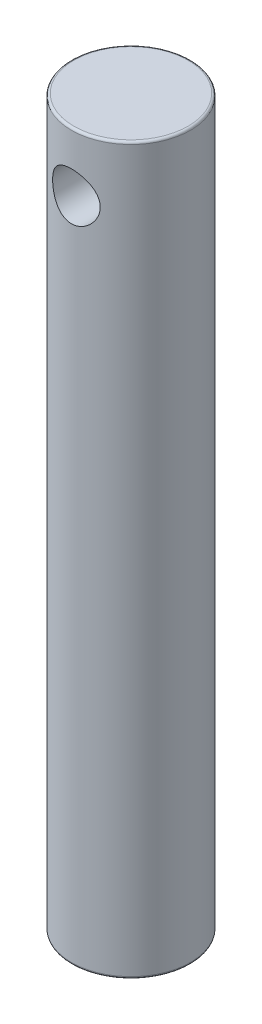
ISO-10303-21;
HEADER;
FILE_DESCRIPTION(('STEP AP214'),'2;1');
FILE_NAME('part.step','',(''),(''),'','','');
FILE_SCHEMA(('AUTOMOTIVE_DESIGN { 1 0 10303 214 1 1 1 1 }'));
ENDSEC;
DATA;
#1=APPLICATION_CONTEXT('core data for automotive mechanical design processes');
#2=APPLICATION_PROTOCOL_DEFINITION('international standard','automotive_design',2000,#1);
#3=PRODUCT_CONTEXT('',#1,'mechanical');
#4=PRODUCT('Part','Part','',(#3));
#5=PRODUCT_RELATED_PRODUCT_CATEGORY('part','',(#4));
#6=PRODUCT_DEFINITION_FORMATION('','',#4);
#7=PRODUCT_DEFINITION_CONTEXT('part definition',#1,'design');
#8=PRODUCT_DEFINITION('design','',#6,#7);
#9=PRODUCT_DEFINITION_SHAPE('','',#8);
#10=(LENGTH_UNIT() NAMED_UNIT(*) SI_UNIT(.MILLI.,.METRE.));
#11=(NAMED_UNIT(*) PLANE_ANGLE_UNIT() SI_UNIT($,.RADIAN.));
#12=(NAMED_UNIT(*) SI_UNIT($,.STERADIAN.) SOLID_ANGLE_UNIT());
#13=UNCERTAINTY_MEASURE_WITH_UNIT(LENGTH_MEASURE(1.E-05),#10,'distance_accuracy_value','');
#14=(GEOMETRIC_REPRESENTATION_CONTEXT(3) GLOBAL_UNCERTAINTY_ASSIGNED_CONTEXT((#13)) GLOBAL_UNIT_ASSIGNED_CONTEXT((#10,
#11,#12)) REPRESENTATION_CONTEXT('',''));
#15=CARTESIAN_POINT('',(0.,0.,0.));
#16=DIRECTION('',(0.,0.,1.));
#17=DIRECTION('',(1.,0.,0.));
#18=AXIS2_PLACEMENT_3D('',#15,#16,#17);
#19=CARTESIAN_POINT('',(0.,0.,0.));
#20=DIRECTION('',(0.,1.,0.));
#21=DIRECTION('',(0.,0.,1.));
#22=AXIS2_PLACEMENT_3D('',#19,#20,#21);
#23=PLANE('',#22);
#24=CARTESIAN_POINT('',(0.,0.,0.));
#25=DIRECTION('',(0.,1.,0.));
#26=DIRECTION('',(0.,0.,1.));
#27=AXIS2_PLACEMENT_3D('',#24,#25,#26);
#28=CIRCLE('',#27,12.);
#29=CARTESIAN_POINT('',(0.,0.,12.));
#30=VERTEX_POINT('',#29);
#31=EDGE_CURVE('E56',#30,#30,#28,.F.);
#32=ORIENTED_EDGE('',*,*,#31,.T.);
#33=EDGE_LOOP('',(#32));
#34=FACE_BOUND('',#33,.T.);
#35=ADVANCED_FACE('F49',(#34),#23,.F.);
#36=CARTESIAN_POINT('',(0.,152.4,0.));
#37=DIRECTION('',(0.,1.,0.));
#38=DIRECTION('',(0.,0.,1.));
#39=AXIS2_PLACEMENT_3D('',#36,#37,#38);
#40=PLANE('',#39);
#41=CARTESIAN_POINT('',(0.,152.4,0.));
#42=DIRECTION('',(0.,1.,0.));
#43=DIRECTION('',(0.,0.,1.));
#44=AXIS2_PLACEMENT_3D('',#41,#42,#43);
#45=CIRCLE('',#44,12.);
#46=CARTESIAN_POINT('',(0.,152.4,12.));
#47=VERTEX_POINT('',#46);
#48=EDGE_CURVE('E11',#47,#47,#45,.T.);
#49=ORIENTED_EDGE('',*,*,#48,.T.);
#50=EDGE_LOOP('',(#49));
#51=FACE_BOUND('',#50,.T.);
#52=ADVANCED_FACE('F96',(#51),#40,.T.);
#53=CARTESIAN_POINT('',(0.,0.,0.));
#54=DIRECTION('',(0.,1.,0.));
#55=DIRECTION('',(0.,0.,1.));
#56=AXIS2_PLACEMENT_3D('',#53,#54,#55);
#57=CYLINDRICAL_SURFACE('',#56,12.5);
#58=CARTESIAN_POINT('',(0.,0.5,0.));
#59=DIRECTION('',(0.,1.,0.));
#60=DIRECTION('',(0.,0.,1.));
#61=AXIS2_PLACEMENT_3D('',#58,#59,#60);
#62=CIRCLE('',#61,12.5);
#63=CARTESIAN_POINT('',(0.,0.5,12.5));
#64=VERTEX_POINT('',#63);
#65=EDGE_CURVE('E60',#64,#64,#62,.T.);
#66=ORIENTED_EDGE('',*,*,#65,.T.);
#67=EDGE_LOOP('',(#66));
#68=FACE_BOUND('',#67,.T.);
#69=CARTESIAN_POINT('',(0.,151.9,0.));
#70=DIRECTION('',(0.,1.,0.));
#71=DIRECTION('',(0.,0.,1.));
#72=AXIS2_PLACEMENT_3D('',#69,#70,#71);
#73=CIRCLE('',#72,12.5);
#74=CARTESIAN_POINT('',(0.,151.9,12.5));
#75=VERTEX_POINT('',#74);
#76=EDGE_CURVE('E64',#75,#75,#73,.F.);
#77=ORIENTED_EDGE('',*,*,#76,.T.);
#78=EDGE_LOOP('',(#77));
#79=FACE_BOUND('',#78,.T.);
#80=CARTESIAN_POINT('',(0.,144.9,-12.5));
#81=CARTESIAN_POINT('',(0.134428040880245,144.899999227433,-12.4999993987147));
#82=CARTESIAN_POINT('',(0.268907963042153,144.894571226906,-12.4978254430454));
#83=CARTESIAN_POINT('',(0.536916320402138,144.872908256117,-12.4891841268811));
#84=CARTESIAN_POINT('',(0.670444059868572,144.856666067978,-12.482713898868));
#85=CARTESIAN_POINT('',(0.935792063184506,144.813491255257,-12.4656328522576));
#86=CARTESIAN_POINT('',(1.06760803727625,144.78653571455,-12.45501315868));
#87=CARTESIAN_POINT('',(1.32834211367394,144.722193495869,-12.4299104474403));
#88=CARTESIAN_POINT('',(1.45725900847256,144.68480255528,-12.4154258511634));
#89=CARTESIAN_POINT('',(1.71081101883519,144.600097686712,-12.3830283866279));
#90=CARTESIAN_POINT('',(1.83546024588383,144.552821089229,-12.3651284371665));
#91=CARTESIAN_POINT('',(2.08021423561347,144.448672994588,-12.3263173159861));
#92=CARTESIAN_POINT('',(2.20031728026545,144.391797913562,-12.3054050199506));
#93=CARTESIAN_POINT('',(2.5525365078776,144.207506936614,-12.2389309759606));
#94=CARTESIAN_POINT('',(2.77691477785267,144.066306786435,-12.1895849490044));
#95=CARTESIAN_POINT('',(3.20878788906516,143.744405075527,-12.0832695338299));
#96=CARTESIAN_POINT('',(3.41514420143945,143.562267799413,-12.0260638001945));
#97=CARTESIAN_POINT('',(3.79544899749701,143.166465534496,-11.9115080425799));
#98=CARTESIAN_POINT('',(3.96938162582803,142.952785212015,-11.8541579618342));
#99=CARTESIAN_POINT('',(4.20603567526882,142.607393942085,-11.7714356850167));
#100=CARTESIAN_POINT('',(4.28222203675303,142.485220084906,-11.7438622045772));
#101=CARTESIAN_POINT('',(4.42396507270082,142.234363844583,-11.6912035308498));
#102=CARTESIAN_POINT('',(4.4895261186149,142.105684166787,-11.6661173159128));
#103=CARTESIAN_POINT('',(4.60945924526238,141.842624566928,-11.6192528850806));
#104=CARTESIAN_POINT('',(4.66383056922586,141.708244260069,-11.5974748929493));
#105=CARTESIAN_POINT('',(4.76082403397005,141.434791130423,-11.5579971517723));
#106=CARTESIAN_POINT('',(4.80345206019441,141.29572069758,-11.5402953605706));
#107=CARTESIAN_POINT('',(4.87487504470654,141.020233803028,-11.5103008899763));
#108=CARTESIAN_POINT('',(4.90420529162586,140.883978665748,-11.4978009817217));
#109=CARTESIAN_POINT('',(4.95140857029289,140.609206324517,-11.4775526697411));
#110=CARTESIAN_POINT('',(4.96928677630621,140.470690171191,-11.4698021202267));
#111=CARTESIAN_POINT('',(4.99338985465939,140.192486721196,-11.4593294452386));
#112=CARTESIAN_POINT('',(4.99961718879243,140.052799678199,-11.4566062575003));
#113=CARTESIAN_POINT('',(5.0003485097598,139.773392457526,-11.4562871877305));
#114=CARTESIAN_POINT('',(4.99485304337849,139.6336722817,-11.4586910665582));
#115=CARTESIAN_POINT('',(4.97300139062979,139.365095752802,-11.4681900884033));
#116=CARTESIAN_POINT('',(4.95743098313014,139.23616251655,-11.4749456688599));
#117=CARTESIAN_POINT('',(4.91636669802671,138.980133169352,-11.4925992446822));
#118=CARTESIAN_POINT('',(4.89086955440044,138.853037677336,-11.5034986033759));
#119=CARTESIAN_POINT('',(4.83020381694143,138.601598275734,-11.5291029107708));
#120=CARTESIAN_POINT('',(4.79503755159834,138.477253711458,-11.5438069431915));
#121=CARTESIAN_POINT('',(4.71535272789896,138.232038157591,-11.5765839862007));
#122=CARTESIAN_POINT('',(4.67083057532248,138.111168523299,-11.5946582912342));
#123=CARTESIAN_POINT('',(4.52178156820716,137.750100229774,-11.6539749295159));
#124=CARTESIAN_POINT('',(4.40296429143379,137.516367028503,-11.6997808532441));
#125=CARTESIAN_POINT('',(4.13125151068097,137.071420317866,-11.7984565398875));
#126=CARTESIAN_POINT('',(3.97834320762598,136.860215310592,-11.851328952839));
#127=CARTESIAN_POINT('',(3.62889137093418,136.448992554911,-11.9631659230739));
#128=CARTESIAN_POINT('',(3.42988845371519,136.251101706164,-12.0222854697289));
#129=CARTESIAN_POINT('',(3.00074126337521,135.890765270535,-12.1365017798563));
#130=CARTESIAN_POINT('',(2.77059080292405,135.728326742903,-12.1915977407036));
#131=CARTESIAN_POINT('',(2.40397180160013,135.513475040348,-12.2673153503505));
#132=CARTESIAN_POINT('',(2.2767950068552,135.446127372932,-12.2916102280984));
#133=CARTESIAN_POINT('',(2.01664956005586,135.322464443625,-12.3369572045585));
#134=CARTESIAN_POINT('',(1.88368330291786,135.266144671861,-12.3580106281118));
#135=CARTESIAN_POINT('',(1.61291597890483,135.165088415445,-12.3962575592558));
#136=CARTESIAN_POINT('',(1.47511586065892,135.120349672337,-12.4134518193484));
#137=CARTESIAN_POINT('',(1.19570710246717,135.042913084145,-12.4434728637469));
#138=CARTESIAN_POINT('',(1.05409872694102,135.010214405384,-12.4562999504395));
#139=CARTESIAN_POINT('',(0.776729176174356,134.958806836453,-12.4765727481541));
#140=CARTESIAN_POINT('',(0.641120300634826,134.939382345743,-12.4842928466038));
#141=CARTESIAN_POINT('',(0.368536353136397,134.911718547215,-12.4953107019161));
#142=CARTESIAN_POINT('',(0.231560830747312,134.903483058669,-12.4986069487295));
#143=CARTESIAN_POINT('',(-0.0425534985314554,134.898303289166,-12.5006785657441));
#144=CARTESIAN_POINT('',(-0.179692155300511,134.901352139062,-12.4994566862774));
#145=CARTESIAN_POINT('',(-0.45319364607851,134.918695177459,-12.4925311411113));
#146=CARTESIAN_POINT('',(-0.5895561770989,134.932993489901,-12.4868258318318));
#147=CARTESIAN_POINT('',(-0.854248709448701,134.971782113967,-12.4714486467531));
#148=CARTESIAN_POINT('',(-0.982662386499644,134.995780406528,-12.4619685467435));
#149=CARTESIAN_POINT('',(-1.236951486414,135.053665031866,-12.4393027914718));
#150=CARTESIAN_POINT('',(-1.36282600376894,135.087554827734,-12.4261158384722));
#151=CARTESIAN_POINT('',(-1.61115102742898,135.16490828446,-12.396363099589));
#152=CARTESIAN_POINT('',(-1.73360251217364,135.208369177319,-12.3797982906969));
#153=CARTESIAN_POINT('',(-1.97439656120157,135.304503016352,-12.3436873636138));
#154=CARTESIAN_POINT('',(-2.0927375418746,135.357179466743,-12.324140111711));
#155=CARTESIAN_POINT('',(-2.44755555665469,135.531907255414,-12.2604306254888));
#156=CARTESIAN_POINT('',(-2.67640599367797,135.668346020799,-12.2121249620384));
#157=CARTESIAN_POINT('',(-3.10864805700673,135.974868476162,-12.1093295542635));
#158=CARTESIAN_POINT('',(-3.31202942740563,136.144965649056,-12.0548373354639));
#159=CARTESIAN_POINT('',(-3.7017918032765,136.527158464545,-11.941130597789));
#160=CARTESIAN_POINT('',(-3.88616393977714,136.741285470906,-11.8818418268267));
#161=CARTESIAN_POINT('',(-4.21689889171291,137.19864859835,-11.7685360307743));
#162=CARTESIAN_POINT('',(-4.36325544343982,137.441889506805,-11.7145198753505));
#163=CARTESIAN_POINT('',(-4.55142555782972,137.825118670316,-11.6421255873514));
#164=CARTESIAN_POINT('',(-4.60914530472445,137.95667972936,-11.6193337971416));
#165=CARTESIAN_POINT('',(-4.7132051604585,138.224787165596,-11.5775147345674));
#166=CARTESIAN_POINT('',(-4.7595502120223,138.361331347702,-11.5584858277923));
#167=CARTESIAN_POINT('',(-4.84036067147022,138.63836312862,-11.5248785506309));
#168=CARTESIAN_POINT('',(-4.87483074938324,138.778849153677,-11.5102984309441));
#169=CARTESIAN_POINT('',(-4.93151664575949,139.062694625953,-11.4861263078956));
#170=CARTESIAN_POINT('',(-4.95373349010208,139.206053831579,-11.4765338869518));
#171=CARTESIAN_POINT('',(-4.9844819536379,139.483998964573,-11.463210572331));
#172=CARTESIAN_POINT('',(-4.99388565688381,139.618471214748,-11.4591065554863));
#173=CARTESIAN_POINT('',(-5.0018009363611,139.887846081921,-11.4556539611994));
#174=CARTESIAN_POINT('',(-5.00030885599691,140.022748828209,-11.4563069802054));
#175=CARTESIAN_POINT('',(-4.98644346125971,140.291817161394,-11.4623486992809));
#176=CARTESIAN_POINT('',(-4.97407559907525,140.425983083765,-11.4677350264728));
#177=CARTESIAN_POINT('',(-4.93860056102212,140.692672045274,-11.4830569283056));
#178=CARTESIAN_POINT('',(-4.91548933784265,140.82519444592,-11.4929942173944));
#179=CARTESIAN_POINT('',(-4.85990688487219,141.082329669663,-11.5166044402177));
#180=CARTESIAN_POINT('',(-4.82784722608916,141.207046793678,-11.5301119705796));
#181=CARTESIAN_POINT('',(-4.75435551317662,141.453266245097,-11.5606089073159));
#182=CARTESIAN_POINT('',(-4.71292020385953,141.574767439538,-11.5775995228101));
#183=CARTESIAN_POINT('',(-4.57505004689657,141.933314434634,-11.6330901679007));
#184=CARTESIAN_POINT('',(-4.46501084942241,142.164587265842,-11.6761269526907));
#185=CARTESIAN_POINT('',(-4.20467910946436,142.619056401713,-11.7724663792633));
#186=CARTESIAN_POINT('',(-4.052442544111,142.841032090103,-11.8262157202004));
#187=CARTESIAN_POINT('',(-3.71470108315129,143.257497882634,-11.9366014488494));
#188=CARTESIAN_POINT('',(-3.52918616017588,143.451979670697,-11.9932387030498));
#189=CARTESIAN_POINT('',(-3.22271513320783,143.725513480365,-12.0779292743326));
#190=CARTESIAN_POINT('',(-3.11206947531874,143.816056467989,-12.1069791824151));
#191=CARTESIAN_POINT('',(-2.88318647887271,143.98749937067,-12.1635153749863));
#192=CARTESIAN_POINT('',(-2.76495189987678,144.06840276075,-12.1910022210713));
#193=CARTESIAN_POINT('',(-2.52148785822199,144.22003376873,-12.2436771245731));
#194=CARTESIAN_POINT('',(-2.39625194428021,144.290751779554,-12.268863003586));
#195=CARTESIAN_POINT('',(-2.13974317443308,144.42130456519,-12.3161883140849));
#196=CARTESIAN_POINT('',(-2.00847311867465,144.481144325443,-12.338329139963));
#197=CARTESIAN_POINT('',(-1.7431850308944,144.588433224325,-12.378569273056));
#198=CARTESIAN_POINT('',(-1.60925996819087,144.636087336391,-12.3967345755768));
#199=CARTESIAN_POINT('',(-1.33744351766941,144.719902333695,-12.4289968049149));
#200=CARTESIAN_POINT('',(-1.19955402639713,144.756068618024,-12.4430956426169));
#201=CARTESIAN_POINT('',(-0.921178994399029,144.816469003764,-12.4667917847092));
#202=CARTESIAN_POINT('',(-0.780700905910178,144.84073306786,-12.4764003899058));
#203=CARTESIAN_POINT('',(-0.498015171774933,144.877174232699,-12.4908758978143));
#204=CARTESIAN_POINT('',(-0.355808918388266,144.889360484779,-12.4957463905343));
#205=CARTESIAN_POINT('',(-0.177825352118351,144.896963660736,-12.4987857872515));
#206=CARTESIAN_POINT('',(-0.142272352477998,144.898102034201,-12.4992409186622));
#207=CARTESIAN_POINT('',(-0.0711474464104167,144.899620305884,-12.4998481045291));
#208=CARTESIAN_POINT('',(-0.0355755399919987,144.900000204455,-12.5000001591264));
#209=CARTESIAN_POINT('',(0.,144.9,-12.5));
#210=B_SPLINE_CURVE_WITH_KNOTS('',3,(#80,#81,#82,#83,#84,#85,#86,#87,#88,#89,#90,#91,#92,#93,
#94,#95,#96,#97,#98,#99,#100,#101,#102,#103,#104,#105,#106,#107,#108,#109,#110,#111,#112,#113,
#114,#115,#116,#117,#118,#119,#120,#121,#122,#123,#124,#125,#126,#127,#128,#129,#130,#131,#132,
#133,#134,#135,#136,#137,#138,#139,#140,#141,#142,#143,#144,#145,#146,#147,#148,#149,#150,#151,
#152,#153,#154,#155,#156,#157,#158,#159,#160,#161,#162,#163,#164,#165,#166,#167,#168,#169,#170,
#171,#172,#173,#174,#175,#176,#177,#178,#179,#180,#181,#182,#183,#184,#185,#186,#187,#188,#189,
#190,#191,#192,#193,#194,#195,#196,#197,#198,#199,#200,#201,#202,#203,#204,#205,#206,#207,#208,
#209),.UNSPECIFIED.,.T.,.F.,(4,2,2,2,2,2,2,2,2,2,2,2,2,2,2,2,2,2,2,2,2,2,2,2,2,2,2,2,2,2,2,2,2,
2,2,2,2,2,2,2,2,2,2,2,2,2,2,2,2,2,2,2,2,2,2,2,2,2,2,2,2,2,2,2,4),(0.,0.403247545127348,
0.806764506023342,1.21114928538012,1.61569948871384,2.01874874890204,2.42194883328357,
3.22723902880424,4.06710473211457,4.90738006296491,5.3467199145422,5.78587855222681,
6.22506688081048,6.66403469721492,7.08328748777368,7.50235071750987,7.92132539047821,
8.34028052171747,8.72995920476623,9.119766205555,9.50947941625399,9.89934261638532,
10.6941760924545,11.4893084834387,12.345906664648,13.2026752559774,13.6400384630794,
14.0772224346054,14.5143210850114,14.9513894641978,15.3624968549506,15.7737445385294,
16.1847419233425,16.5958900459694,16.9883780843378,17.3810037009245,17.7735159174187,
18.1661777124847,18.9747143225964,19.783575475114,20.6458383532501,21.5082432137335,
21.9441519877961,22.379871006724,22.815418475839,23.2509294740085,23.655003908265,
24.0592139550412,24.4632214808538,24.8673813305822,25.2553678352619,25.6434892545336,
26.4191721859434,27.2392679922317,28.0596113245242,28.4968494117638,28.9339293970248,
29.3714189832268,29.8087075621829,30.2380680730948,30.667226491969,31.0952989296225,
31.5230467689858,31.6297637586308,31.7364806985967),.UNSPECIFIED.);
#211=CARTESIAN_POINT('',(0.,144.9,-12.5));
#212=VERTEX_POINT('',#211);
#213=EDGE_CURVE('E69',#212,#212,#210,.T.);
#214=ORIENTED_EDGE('',*,*,#213,.F.);
#215=EDGE_LOOP('',(#214));
#216=FACE_BOUND('',#215,.T.);
#217=CARTESIAN_POINT('',(0.,134.9,12.5));
#218=CARTESIAN_POINT('',(0.134428040880244,134.900000772567,12.4999993987147));
#219=CARTESIAN_POINT('',(0.268907963042151,134.905428773094,12.4978254430454));
#220=CARTESIAN_POINT('',(0.536916320402137,134.927091743883,12.4891841268811));
#221=CARTESIAN_POINT('',(0.670444059868572,134.943333932021,12.482713898868));
#222=CARTESIAN_POINT('',(0.935792063184506,134.986508744743,12.4656328522576));
#223=CARTESIAN_POINT('',(1.06760803727625,135.013464285449,12.45501315868));
#224=CARTESIAN_POINT('',(1.32834211367394,135.077806504131,12.4299104474403));
#225=CARTESIAN_POINT('',(1.45725900847257,135.11519744472,12.4154258511634));
#226=CARTESIAN_POINT('',(1.71081101883518,135.199902313288,12.3830283866279));
#227=CARTESIAN_POINT('',(1.83546024588382,135.247178910771,12.3651284371665));
#228=CARTESIAN_POINT('',(2.08021423561346,135.351327005412,12.3263173159861));
#229=CARTESIAN_POINT('',(2.20031728026544,135.408202086437,12.3054050199506));
#230=CARTESIAN_POINT('',(2.5525365078776,135.592493063386,12.2389309759606));
#231=CARTESIAN_POINT('',(2.77691477785267,135.733693213565,12.1895849490044));
#232=CARTESIAN_POINT('',(3.20878788906516,136.055594924473,12.0832695338299));
#233=CARTESIAN_POINT('',(3.41514420143945,136.237732200587,12.0260638001945));
#234=CARTESIAN_POINT('',(3.79544899749701,136.633534465503,11.9115080425799));
#235=CARTESIAN_POINT('',(3.96938162582803,136.847214787985,11.8541579618342));
#236=CARTESIAN_POINT('',(4.20603567526881,137.192606057915,11.7714356850167));
#237=CARTESIAN_POINT('',(4.28222203675301,137.314779915094,11.7438622045772));
#238=CARTESIAN_POINT('',(4.42396507270081,137.565636155417,11.6912035308498));
#239=CARTESIAN_POINT('',(4.4895261186149,137.694315833213,11.6661173159128));
#240=CARTESIAN_POINT('',(4.60945924526237,137.957375433072,11.6192528850806));
#241=CARTESIAN_POINT('',(4.66383056922586,138.091755739931,11.5974748929493));
#242=CARTESIAN_POINT('',(4.76082403397005,138.365208869577,11.5579971517723));
#243=CARTESIAN_POINT('',(4.80345206019441,138.50427930242,11.5402953605706));
#244=CARTESIAN_POINT('',(4.87487504470654,138.779766196972,11.5103008899763));
#245=CARTESIAN_POINT('',(4.90420529162586,138.916021334252,11.4978009817217));
#246=CARTESIAN_POINT('',(4.95140857029289,139.190793675483,11.4775526697411));
#247=CARTESIAN_POINT('',(4.9692867763062,139.329309828809,11.4698021202267));
#248=CARTESIAN_POINT('',(4.99338985465939,139.607513278804,11.4593294452386));
#249=CARTESIAN_POINT('',(4.99961718879243,139.747200321801,11.4566062575003));
#250=CARTESIAN_POINT('',(5.0003485097598,140.026607542473,11.4562871877305));
#251=CARTESIAN_POINT('',(4.99485304337849,140.1663277183,11.4586910665582));
#252=CARTESIAN_POINT('',(4.97300139062979,140.434904247198,11.4681900884033));
#253=CARTESIAN_POINT('',(4.95743098313014,140.56383748345,11.4749456688599));
#254=CARTESIAN_POINT('',(4.91636669802671,140.819866830648,11.4925992446822));
#255=CARTESIAN_POINT('',(4.89086955440044,140.946962322664,11.5034986033759));
#256=CARTESIAN_POINT('',(4.83020381694143,141.198401724266,11.5291029107708));
#257=CARTESIAN_POINT('',(4.79503755159834,141.322746288542,11.5438069431915));
#258=CARTESIAN_POINT('',(4.71535272789897,141.567961842409,11.5765839862007));
#259=CARTESIAN_POINT('',(4.67083057532248,141.688831476701,11.5946582912342));
#260=CARTESIAN_POINT('',(4.52178156820716,142.049899770226,11.6539749295159));
#261=CARTESIAN_POINT('',(4.40296429143379,142.283632971497,11.6997808532441));
#262=CARTESIAN_POINT('',(4.13125151068097,142.728579682134,11.7984565398875));
#263=CARTESIAN_POINT('',(3.97834320762598,142.939784689408,11.851328952839));
#264=CARTESIAN_POINT('',(3.62889137093418,143.351007445089,11.9631659230739));
#265=CARTESIAN_POINT('',(3.42988845371518,143.548898293836,12.0222854697289));
#266=CARTESIAN_POINT('',(3.00074126337521,143.909234729465,12.1365017798563));
#267=CARTESIAN_POINT('',(2.77059080292404,144.071673257097,12.1915977407036));
#268=CARTESIAN_POINT('',(2.40397180160013,144.286524959652,12.2673153503505));
#269=CARTESIAN_POINT('',(2.2767950068552,144.353872627068,12.2916102280984));
#270=CARTESIAN_POINT('',(2.01664956005586,144.477535556375,12.3369572045585));
#271=CARTESIAN_POINT('',(1.88368330291787,144.533855328139,12.3580106281118));
#272=CARTESIAN_POINT('',(1.61291597890484,144.634911584554,12.3962575592558));
#273=CARTESIAN_POINT('',(1.47511586065892,144.679650327663,12.4134518193484));
#274=CARTESIAN_POINT('',(1.19570710246718,144.757086915855,12.4434728637469));
#275=CARTESIAN_POINT('',(1.05409872694102,144.789785594616,12.4562999504395));
#276=CARTESIAN_POINT('',(0.776729176174355,144.841193163546,12.4765727481541));
#277=CARTESIAN_POINT('',(0.641120300634824,144.860617654257,12.4842928466038));
#278=CARTESIAN_POINT('',(0.368536353136395,144.888281452785,12.4953107019161));
#279=CARTESIAN_POINT('',(0.23156083074731,144.89651694133,12.4986069487295));
#280=CARTESIAN_POINT('',(-0.0425534985314563,144.901696710834,12.5006785657441));
#281=CARTESIAN_POINT('',(-0.179692155300512,144.898647860938,12.4994566862774));
#282=CARTESIAN_POINT('',(-0.453193646078511,144.881304822541,12.4925311411113));
#283=CARTESIAN_POINT('',(-0.5895561770989,144.867006510099,12.4868258318318));
#284=CARTESIAN_POINT('',(-0.854248709448701,144.828217886033,12.4714486467531));
#285=CARTESIAN_POINT('',(-0.982662386499644,144.804219593472,12.4619685467435));
#286=CARTESIAN_POINT('',(-1.236951486414,144.746334968134,12.4393027914718));
#287=CARTESIAN_POINT('',(-1.36282600376894,144.712445172266,12.4261158384722));
#288=CARTESIAN_POINT('',(-1.61115102742898,144.63509171554,12.396363099589));
#289=CARTESIAN_POINT('',(-1.73360251217364,144.591630822681,12.3797982906969));
#290=CARTESIAN_POINT('',(-1.97439656120157,144.495496983648,12.3436873636138));
#291=CARTESIAN_POINT('',(-2.0927375418746,144.442820533257,12.324140111711));
#292=CARTESIAN_POINT('',(-2.44755555665469,144.268092744586,12.2604306254888));
#293=CARTESIAN_POINT('',(-2.67640599367797,144.131653979201,12.2121249620384));
#294=CARTESIAN_POINT('',(-3.10864805700673,143.825131523838,12.1093295542635));
#295=CARTESIAN_POINT('',(-3.31202942740563,143.655034350944,12.0548373354639));
#296=CARTESIAN_POINT('',(-3.7017918032765,143.272841535455,11.941130597789));
#297=CARTESIAN_POINT('',(-3.88616393977714,143.058714529094,11.8818418268267));
#298=CARTESIAN_POINT('',(-4.21689889171291,142.60135140165,11.7685360307743));
#299=CARTESIAN_POINT('',(-4.36325544343982,142.358110493195,11.7145198753505));
#300=CARTESIAN_POINT('',(-4.55142555782972,141.974881329683,11.6421255873514));
#301=CARTESIAN_POINT('',(-4.60914530472445,141.84332027064,11.6193337971416));
#302=CARTESIAN_POINT('',(-4.7132051604585,141.575212834404,11.5775147345674));
#303=CARTESIAN_POINT('',(-4.7595502120223,141.438668652298,11.5584858277923));
#304=CARTESIAN_POINT('',(-4.84036067147022,141.16163687138,11.5248785506309));
#305=CARTESIAN_POINT('',(-4.87483074938324,141.021150846323,11.5102984309441));
#306=CARTESIAN_POINT('',(-4.93151664575949,140.737305374047,11.4861263078956));
#307=CARTESIAN_POINT('',(-4.95373349010208,140.593946168421,11.4765338869518));
#308=CARTESIAN_POINT('',(-4.9844819536379,140.316001035427,11.463210572331));
#309=CARTESIAN_POINT('',(-4.99388565688381,140.181528785252,11.4591065554863));
#310=CARTESIAN_POINT('',(-5.00180093636109,139.912153918079,11.4556539611994));
#311=CARTESIAN_POINT('',(-5.00030885599691,139.777251171791,11.4563069802054));
#312=CARTESIAN_POINT('',(-4.98644346125971,139.508182838606,11.4623486992809));
#313=CARTESIAN_POINT('',(-4.97407559907526,139.374016916235,11.4677350264728));
#314=CARTESIAN_POINT('',(-4.93860056102212,139.107327954726,11.4830569283056));
#315=CARTESIAN_POINT('',(-4.91548933784266,138.97480555408,11.4929942173944));
#316=CARTESIAN_POINT('',(-4.85990688487219,138.717670330337,11.5166044402177));
#317=CARTESIAN_POINT('',(-4.82784722608916,138.592953206322,11.5301119705796));
#318=CARTESIAN_POINT('',(-4.75435551317662,138.346733754903,11.5606089073159));
#319=CARTESIAN_POINT('',(-4.71292020385953,138.225232560462,11.5775995228101));
#320=CARTESIAN_POINT('',(-4.57505004689657,137.866685565366,11.6330901679007));
#321=CARTESIAN_POINT('',(-4.46501084942241,137.635412734158,11.6761269526907));
#322=CARTESIAN_POINT('',(-4.20467910946436,137.180943598287,11.7724663792633));
#323=CARTESIAN_POINT('',(-4.052442544111,136.958967909897,11.8262157202004));
#324=CARTESIAN_POINT('',(-3.71470108315128,136.542502117366,11.9366014488494));
#325=CARTESIAN_POINT('',(-3.52918616017588,136.348020329303,11.9932387030498));
#326=CARTESIAN_POINT('',(-3.22271513320783,136.074486519635,12.0779292743326));
#327=CARTESIAN_POINT('',(-3.11206947531874,135.983943532011,12.1069791824151));
#328=CARTESIAN_POINT('',(-2.88318647887271,135.81250062933,12.1635153749863));
#329=CARTESIAN_POINT('',(-2.76495189987678,135.73159723925,12.1910022210713));
#330=CARTESIAN_POINT('',(-2.52148785822199,135.57996623127,12.2436771245731));
#331=CARTESIAN_POINT('',(-2.3962519442802,135.509248220446,12.268863003586));
#332=CARTESIAN_POINT('',(-2.13974317443307,135.37869543481,12.3161883140849));
#333=CARTESIAN_POINT('',(-2.00847311867465,135.318855674557,12.338329139963));
#334=CARTESIAN_POINT('',(-1.7431850308944,135.211566775675,12.378569273056));
#335=CARTESIAN_POINT('',(-1.60925996819087,135.163912663609,12.3967345755768));
#336=CARTESIAN_POINT('',(-1.33744351766941,135.080097666305,12.4289968049149));
#337=CARTESIAN_POINT('',(-1.19955402639713,135.043931381976,12.4430956426169));
#338=CARTESIAN_POINT('',(-0.921178994399028,134.983530996236,12.4667917847092));
#339=CARTESIAN_POINT('',(-0.780700905910176,134.95926693214,12.4764003899058));
#340=CARTESIAN_POINT('',(-0.498015171774931,134.922825767301,12.4908758978143));
#341=CARTESIAN_POINT('',(-0.355808918388265,134.910639515221,12.4957463905343));
#342=CARTESIAN_POINT('',(-0.177825352118351,134.903036339264,12.4987857872515));
#343=CARTESIAN_POINT('',(-0.142272352477998,134.901897965799,12.4992409186622));
#344=CARTESIAN_POINT('',(-0.0711474464104167,134.900379694116,12.4998481045291));
#345=CARTESIAN_POINT('',(-0.0355755399919987,134.899999795545,12.5000001591264));
#346=CARTESIAN_POINT('',(0.,134.9,12.5));
#347=B_SPLINE_CURVE_WITH_KNOTS('',3,(#217,#218,#219,#220,#221,#222,#223,#224,#225,#226,#227,
#228,#229,#230,#231,#232,#233,#234,#235,#236,#237,#238,#239,#240,#241,#242,#243,#244,#245,#246,
#247,#248,#249,#250,#251,#252,#253,#254,#255,#256,#257,#258,#259,#260,#261,#262,#263,#264,#265,
#266,#267,#268,#269,#270,#271,#272,#273,#274,#275,#276,#277,#278,#279,#280,#281,#282,#283,#284,
#285,#286,#287,#288,#289,#290,#291,#292,#293,#294,#295,#296,#297,#298,#299,#300,#301,#302,#303,
#304,#305,#306,#307,#308,#309,#310,#311,#312,#313,#314,#315,#316,#317,#318,#319,#320,#321,#322,
#323,#324,#325,#326,#327,#328,#329,#330,#331,#332,#333,#334,#335,#336,#337,#338,#339,#340,#341,
#342,#343,#344,#345,#346),.UNSPECIFIED.,.T.,.F.,(4,2,2,2,2,2,2,2,2,2,2,2,2,2,2,2,2,2,2,2,2,2,2,
2,2,2,2,2,2,2,2,2,2,2,2,2,2,2,2,2,2,2,2,2,2,2,2,2,2,2,2,2,2,2,2,2,2,2,2,2,2,2,2,2,4),(0.,
0.403247545127346,0.806764506023342,1.21114928538012,1.61569948871384,2.01874874890202,
2.42194883328357,3.22723902880424,4.06710473211456,4.90738006296491,5.34671991454214,
5.78587855222681,6.22506688081048,6.66403469721492,7.08328748777368,7.50235071750981,
7.9213253904781,8.34028052171747,8.72995920476626,9.119766205555,9.50947941625396,
9.89934261638532,10.6941760924545,11.4893084834387,12.345906664648,13.2026752559774,
13.6400384630794,14.0772224346053,14.5143210850114,14.9513894641978,15.3624968549506,
15.7737445385294,16.1847419233425,16.5958900459694,16.9883780843378,17.3810037009245,
17.7735159174187,18.1661777124847,18.9747143225964,19.783575475114,20.6458383532501,
21.5082432137335,21.9441519877961,22.379871006724,22.815418475839,23.2509294740085,
23.655003908265,24.0592139550412,24.4632214808537,24.8673813305822,25.2553678352619,
25.6434892545336,26.4191721859434,27.2392679922317,28.0596113245242,28.4968494117638,
28.9339293970248,29.3714189832268,29.8087075621829,30.2380680730948,30.667226491969,
31.0952989296225,31.5230467689858,31.6297637586308,31.7364806985967),.UNSPECIFIED.);
#348=CARTESIAN_POINT('',(0.,134.9,12.5));
#349=VERTEX_POINT('',#348);
#350=EDGE_CURVE('E77',#349,#349,#347,.T.);
#351=ORIENTED_EDGE('',*,*,#350,.F.);
#352=EDGE_LOOP('',(#351));
#353=FACE_BOUND('',#352,.T.);
#354=ADVANCED_FACE('F81',(#68,#79,#216,#353),#57,.T.);
#355=CARTESIAN_POINT('',(0.,139.9,-12.5));
#356=DIRECTION('',(0.,0.,1.));
#357=DIRECTION('',(1.,0.,0.));
#358=AXIS2_PLACEMENT_3D('',#355,#356,#357);
#359=CYLINDRICAL_SURFACE('',#358,5.);
#360=ORIENTED_EDGE('',*,*,#350,.T.);
#361=EDGE_LOOP('',(#360));
#362=FACE_BOUND('',#361,.T.);
#363=ORIENTED_EDGE('',*,*,#213,.T.);
#364=EDGE_LOOP('',(#363));
#365=FACE_BOUND('',#364,.T.);
#366=ADVANCED_FACE('F84',(#362,#365),#359,.F.);
#367=CARTESIAN_POINT('',(0.,0.5,0.));
#368=DIRECTION('',(0.,1.,0.));
#369=DIRECTION('',(0.,0.,1.));
#370=AXIS2_PLACEMENT_3D('',#367,#368,#369);
#371=TOROIDAL_SURFACE('',#370,12.,0.5);
#372=ORIENTED_EDGE('',*,*,#31,.F.);
#373=EDGE_LOOP('',(#372));
#374=FACE_BOUND('',#373,.T.);
#375=ORIENTED_EDGE('',*,*,#65,.F.);
#376=EDGE_LOOP('',(#375));
#377=FACE_BOUND('',#376,.T.);
#378=ADVANCED_FACE('F87',(#374,#377),#371,.T.);
#379=CARTESIAN_POINT('',(0.,151.9,0.));
#380=DIRECTION('',(0.,1.,0.));
#381=DIRECTION('',(0.,0.,1.));
#382=AXIS2_PLACEMENT_3D('',#379,#380,#381);
#383=TOROIDAL_SURFACE('',#382,12.,0.5);
#384=ORIENTED_EDGE('',*,*,#76,.F.);
#385=EDGE_LOOP('',(#384));
#386=FACE_BOUND('',#385,.T.);
#387=ORIENTED_EDGE('',*,*,#48,.F.);
#388=EDGE_LOOP('',(#387));
#389=FACE_BOUND('',#388,.T.);
#390=ADVANCED_FACE('F51',(#386,#389),#383,.T.);
#391=CLOSED_SHELL('',(#35,#52,#354,#366,#378,#390));
#392=MANIFOLD_SOLID_BREP('B2',#391);
#393=ADVANCED_BREP_SHAPE_REPRESENTATION('',(#18,#392),#14);
#394=SHAPE_DEFINITION_REPRESENTATION(#9,#393);
ENDSEC;
END-ISO-10303-21;
